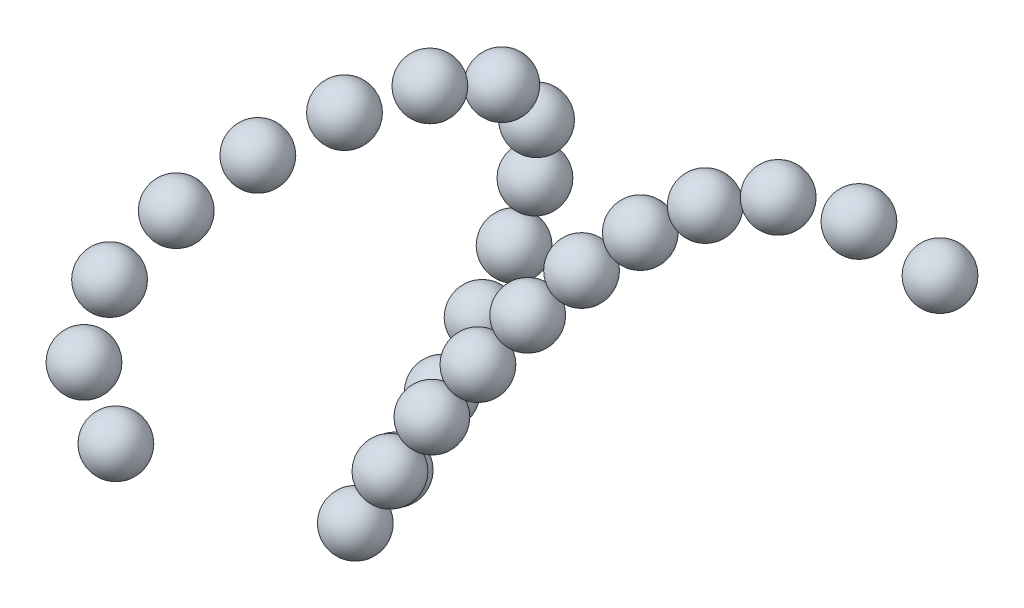
ISO-10303-21;
HEADER;
FILE_DESCRIPTION(('STEP AP214'),'2;1');
FILE_NAME('part.step','',(''),(''),'','','');
FILE_SCHEMA(('AUTOMOTIVE_DESIGN { 1 0 10303 214 1 1 1 1 }'));
ENDSEC;
DATA;
#1=APPLICATION_CONTEXT('core data for automotive mechanical design processes');
#2=APPLICATION_PROTOCOL_DEFINITION('international standard','automotive_design',2000,#1);
#3=PRODUCT_CONTEXT('',#1,'mechanical');
#4=PRODUCT('Part','Part','',(#3));
#5=PRODUCT_RELATED_PRODUCT_CATEGORY('part','',(#4));
#6=PRODUCT_DEFINITION_FORMATION('','',#4);
#7=PRODUCT_DEFINITION_CONTEXT('part definition',#1,'design');
#8=PRODUCT_DEFINITION('design','',#6,#7);
#9=PRODUCT_DEFINITION_SHAPE('','',#8);
#10=(LENGTH_UNIT() NAMED_UNIT(*) SI_UNIT(.MILLI.,.METRE.));
#11=(NAMED_UNIT(*) PLANE_ANGLE_UNIT() SI_UNIT($,.RADIAN.));
#12=(NAMED_UNIT(*) SI_UNIT($,.STERADIAN.) SOLID_ANGLE_UNIT());
#13=UNCERTAINTY_MEASURE_WITH_UNIT(LENGTH_MEASURE(1.E-05),#10,'distance_accuracy_value','');
#14=(GEOMETRIC_REPRESENTATION_CONTEXT(3) GLOBAL_UNCERTAINTY_ASSIGNED_CONTEXT((#13)) GLOBAL_UNIT_ASSIGNED_CONTEXT((#10,
#11,#12)) REPRESENTATION_CONTEXT('',''));
#15=CARTESIAN_POINT('',(0.,0.,0.));
#16=DIRECTION('',(0.,0.,1.));
#17=DIRECTION('',(1.,0.,0.));
#18=AXIS2_PLACEMENT_3D('',#15,#16,#17);
#19=CARTESIAN_POINT('',(-251.332586910343,-8.31631569000842,321.203037515905));
#20=DIRECTION('',(0.,1.,0.));
#21=DIRECTION('',(0.,0.,-1.));
#22=AXIS2_PLACEMENT_3D('',#19,#20,#21);
#23=SPHERICAL_SURFACE('',#22,16.6630073811328);
#24=CARTESIAN_POINT('',(-251.332586910343,8.34669169112437,321.203037515905));
#25=VERTEX_POINT('',#24);
#26=VERTEX_LOOP('',#25);
#27=FACE_BOUND('',#26,.T.);
#28=ADVANCED_FACE('F35',(#27),#23,.T.);
#29=CLOSED_SHELL('',(#28));
#30=MANIFOLD_SOLID_BREP('B2',#29);
#31=CARTESIAN_POINT('',(-293.923176967174,2.73844142392129,298.398368466478));
#32=DIRECTION('',(0.,1.,0.));
#33=DIRECTION('',(0.,0.,-1.));
#34=AXIS2_PLACEMENT_3D('',#31,#32,#33);
#35=SPHERICAL_SURFACE('',#34,16.6630073811328);
#36=CARTESIAN_POINT('',(-293.923176967174,19.4014488050541,298.398368466478));
#37=VERTEX_POINT('',#36);
#38=VERTEX_LOOP('',#37);
#39=FACE_BOUND('',#38,.T.);
#40=ADVANCED_FACE('F53',(#39),#35,.T.);
#41=CLOSED_SHELL('',(#40));
#42=MANIFOLD_SOLID_BREP('B6',#41);
#43=CARTESIAN_POINT('',(-319.059133540797,14.1268048959813,257.373121126579));
#44=DIRECTION('',(0.,1.,0.));
#45=DIRECTION('',(0.,0.,-1.));
#46=AXIS2_PLACEMENT_3D('',#43,#44,#45);
#47=SPHERICAL_SURFACE('',#46,16.6630073811328);
#48=CARTESIAN_POINT('',(-319.059133540797,30.7898122771141,257.373121126579));
#49=VERTEX_POINT('',#48);
#50=VERTEX_LOOP('',#49);
#51=FACE_BOUND('',#50,.T.);
#52=ADVANCED_FACE('F71',(#51),#47,.T.);
#53=CLOSED_SHELL('',(#52));
#54=MANIFOLD_SOLID_BREP('B31',#53);
#55=CARTESIAN_POINT('',(-326.170180751558,23.3578631800315,208.898601720223));
#56=DIRECTION('',(0.,1.,0.));
#57=DIRECTION('',(0.,0.,-1.));
#58=AXIS2_PLACEMENT_3D('',#55,#56,#57);
#59=SPHERICAL_SURFACE('',#58,16.6630073811328);
#60=CARTESIAN_POINT('',(-326.170180751558,40.0208705611642,208.898601720223));
#61=VERTEX_POINT('',#60);
#62=VERTEX_LOOP('',#61);
#63=FACE_BOUND('',#62,.T.);
#64=ADVANCED_FACE('F89',(#63),#59,.T.);
#65=CLOSED_SHELL('',(#64));
#66=MANIFOLD_SOLID_BREP('B49',#65);
#67=CARTESIAN_POINT('',(-325.201124377718,28.7571271886538,159.237148665191));
#68=DIRECTION('',(0.,1.,0.));
#69=DIRECTION('',(0.,0.,-1.));
#70=AXIS2_PLACEMENT_3D('',#67,#68,#69);
#71=SPHERICAL_SURFACE('',#70,16.6630073811328);
#72=CARTESIAN_POINT('',(-325.201124377718,45.4201345697865,159.237148665191));
#73=VERTEX_POINT('',#72);
#74=VERTEX_LOOP('',#73);
#75=FACE_BOUND('',#74,.T.);
#76=ADVANCED_FACE('F107',(#75),#71,.T.);
#77=CLOSED_SHELL('',(#76));
#78=MANIFOLD_SOLID_BREP('B67',#77);
#79=CARTESIAN_POINT('',(-321.223723213114,28.7782493936753,109.432174602055));
#80=DIRECTION('',(0.,1.,0.));
#81=DIRECTION('',(0.,0.,-1.));
#82=AXIS2_PLACEMENT_3D('',#79,#80,#81);
#83=SPHERICAL_SURFACE('',#82,16.6630073811328);
#84=CARTESIAN_POINT('',(-321.223723213114,45.4412567748081,109.432174602055));
#85=VERTEX_POINT('',#84);
#86=VERTEX_LOOP('',#85);
#87=FACE_BOUND('',#86,.T.);
#88=ADVANCED_FACE('F125',(#87),#83,.T.);
#89=CLOSED_SHELL('',(#88));
#90=MANIFOLD_SOLID_BREP('B85',#89);
#91=CARTESIAN_POINT('',(-317.302235347078,20.5820931474702,60.3610732469597));
#92=DIRECTION('',(0.,1.,0.));
#93=DIRECTION('',(0.,0.,-1.));
#94=AXIS2_PLACEMENT_3D('',#91,#92,#93);
#95=SPHERICAL_SURFACE('',#94,16.6630073811328);
#96=CARTESIAN_POINT('',(-317.302235347078,37.245100528603,60.3610732469597));
#97=VERTEX_POINT('',#96);
#98=VERTEX_LOOP('',#97);
#99=FACE_BOUND('',#98,.T.);
#100=ADVANCED_FACE('F143',(#99),#95,.T.);
#101=CLOSED_SHELL('',(#100));
#102=MANIFOLD_SOLID_BREP('B103',#101);
#103=CARTESIAN_POINT('',(-317.323716378429,-1.10490329116494,15.6753807634191));
#104=DIRECTION('',(0.,1.,0.));
#105=DIRECTION('',(0.,0.,-1.));
#106=AXIS2_PLACEMENT_3D('',#103,#104,#105);
#107=SPHERICAL_SURFACE('',#106,16.6630073811328);
#108=CARTESIAN_POINT('',(-317.323716378429,15.5581040899678,15.6753807634191));
#109=VERTEX_POINT('',#108);
#110=VERTEX_LOOP('',#109);
#111=FACE_BOUND('',#110,.T.);
#112=ADVANCED_FACE('F161',(#111),#107,.T.);
#113=CLOSED_SHELL('',(#112));
#114=MANIFOLD_SOLID_BREP('B121',#113);
#115=CARTESIAN_POINT('',(-325.916391497109,-39.3436940346708,-14.4857159539056));
#116=DIRECTION('',(0.,1.,0.));
#117=DIRECTION('',(0.,0.,-1.));
#118=AXIS2_PLACEMENT_3D('',#115,#116,#117);
#119=SPHERICAL_SURFACE('',#118,16.6630073811328);
#120=CARTESIAN_POINT('',(-325.916391497109,-22.680686653538,-14.4857159539056));
#121=VERTEX_POINT('',#120);
#122=VERTEX_LOOP('',#121);
#123=FACE_BOUND('',#122,.T.);
#124=ADVANCED_FACE('F179',(#123),#119,.T.);
#125=CLOSED_SHELL('',(#124));
#126=MANIFOLD_SOLID_BREP('B139',#125);
#127=CARTESIAN_POINT('',(-340.66666430228,-84.9409793318818,-28.2143946089285));
#128=DIRECTION('',(0.,1.,0.));
#129=DIRECTION('',(0.,0.,-1.));
#130=AXIS2_PLACEMENT_3D('',#127,#128,#129);
#131=SPHERICAL_SURFACE('',#130,16.6630073811328);
#132=CARTESIAN_POINT('',(-340.66666430228,-68.277971950749,-28.2143946089285));
#133=VERTEX_POINT('',#132);
#134=VERTEX_LOOP('',#133);
#135=FACE_BOUND('',#134,.T.);
#136=ADVANCED_FACE('F197',(#135),#131,.T.);
#137=CLOSED_SHELL('',(#136));
#138=MANIFOLD_SOLID_BREP('B157',#137);
#139=CARTESIAN_POINT('',(-357.698814044844,-131.72175381273,-32.321950558602));
#140=DIRECTION('',(0.,1.,0.));
#141=DIRECTION('',(0.,0.,-1.));
#142=AXIS2_PLACEMENT_3D('',#139,#140,#141);
#143=SPHERICAL_SURFACE('',#142,16.6630073811328);
#144=CARTESIAN_POINT('',(-357.698814044844,-115.058746431597,-32.321950558602));
#145=VERTEX_POINT('',#144);
#146=VERTEX_LOOP('',#145);
#147=FACE_BOUND('',#146,.T.);
#148=ADVANCED_FACE('F215',(#147),#143,.T.);
#149=CLOSED_SHELL('',(#148));
#150=MANIFOLD_SOLID_BREP('B175',#149);
#151=CARTESIAN_POINT('',(-375.649687370762,-178.326077860857,-30.4093126891423));
#152=DIRECTION('',(0.,1.,0.));
#153=DIRECTION('',(0.,0.,-1.));
#154=AXIS2_PLACEMENT_3D('',#151,#152,#153);
#155=SPHERICAL_SURFACE('',#154,16.6630073811328);
#156=CARTESIAN_POINT('',(-375.649687370762,-161.663070479724,-30.4093126891423));
#157=VERTEX_POINT('',#156);
#158=VERTEX_LOOP('',#157);
#159=FACE_BOUND('',#158,.T.);
#160=ADVANCED_FACE('F233',(#159),#155,.T.);
#161=CLOSED_SHELL('',(#160));
#162=MANIFOLD_SOLID_BREP('B193',#161);
#163=CARTESIAN_POINT('',(-393.917545592033,-224.398705766813,-23.9263707546768));
#164=DIRECTION('',(0.,1.,0.));
#165=DIRECTION('',(0.,0.,-1.));
#166=AXIS2_PLACEMENT_3D('',#163,#164,#165);
#167=SPHERICAL_SURFACE('',#166,16.6630073811328);
#168=CARTESIAN_POINT('',(-393.917545592033,-207.73569838568,-23.9263707546768));
#169=VERTEX_POINT('',#168);
#170=VERTEX_LOOP('',#169);
#171=FACE_BOUND('',#170,.T.);
#172=ADVANCED_FACE('F251',(#171),#167,.T.);
#173=CLOSED_SHELL('',(#172));
#174=MANIFOLD_SOLID_BREP('B211',#173);
#175=CARTESIAN_POINT('',(-411.92810765752,-269.655591038368,-12.7611431348232));
#176=DIRECTION('',(0.,1.,0.));
#177=DIRECTION('',(0.,0.,-1.));
#178=AXIS2_PLACEMENT_3D('',#175,#176,#177);
#179=SPHERICAL_SURFACE('',#178,16.6630073811328);
#180=CARTESIAN_POINT('',(-411.92810765752,-252.992583657235,-12.7611431348232));
#181=VERTEX_POINT('',#180);
#182=VERTEX_LOOP('',#181);
#183=FACE_BOUND('',#182,.T.);
#184=ADVANCED_FACE('F269',(#183),#179,.T.);
#185=CLOSED_SHELL('',(#184));
#186=MANIFOLD_SOLID_BREP('B229',#185);
#187=CARTESIAN_POINT('',(-414.891981622737,-288.918953339259,9.03957575350619));
#188=DIRECTION('',(0.,1.,0.));
#189=DIRECTION('',(0.,0.,-1.));
#190=AXIS2_PLACEMENT_3D('',#187,#188,#189);
#191=SPHERICAL_SURFACE('',#190,16.6630073811328);
#192=CARTESIAN_POINT('',(-414.891981622737,-272.255945958126,9.03957575350619));
#193=VERTEX_POINT('',#192);
#194=VERTEX_LOOP('',#193);
#195=FACE_BOUND('',#194,.T.);
#196=ADVANCED_FACE('F287',(#195),#191,.T.);
#197=CLOSED_SHELL('',(#196));
#198=MANIFOLD_SOLID_BREP('B247',#197);
#199=CARTESIAN_POINT('',(-389.364345904457,-246.176479457318,13.0898069452068));
#200=DIRECTION('',(0.,1.,0.));
#201=DIRECTION('',(0.,0.,-1.));
#202=AXIS2_PLACEMENT_3D('',#199,#200,#201);
#203=SPHERICAL_SURFACE('',#202,16.6630073811328);
#204=CARTESIAN_POINT('',(-389.364345904457,-229.513472076185,13.0898069452068));
#205=VERTEX_POINT('',#204);
#206=VERTEX_LOOP('',#205);
#207=FACE_BOUND('',#206,.T.);
#208=ADVANCED_FACE('F305',(#207),#203,.T.);
#209=CLOSED_SHELL('',(#208));
#210=MANIFOLD_SOLID_BREP('B265',#209);
#211=CARTESIAN_POINT('',(-362.981510258502,-203.709905211744,13.4456533905823));
#212=DIRECTION('',(0.,1.,0.));
#213=DIRECTION('',(0.,0.,-1.));
#214=AXIS2_PLACEMENT_3D('',#211,#212,#213);
#215=SPHERICAL_SURFACE('',#214,16.6630073811328);
#216=CARTESIAN_POINT('',(-362.981510258502,-187.046897830612,13.4456533905823));
#217=VERTEX_POINT('',#216);
#218=VERTEX_LOOP('',#217);
#219=FACE_BOUND('',#218,.T.);
#220=ADVANCED_FACE('F323',(#219),#215,.T.);
#221=CLOSED_SHELL('',(#220));
#222=MANIFOLD_SOLID_BREP('B283',#221);
#223=CARTESIAN_POINT('',(-335.281122892169,-162.097476910306,12.5694839886181));
#224=DIRECTION('',(0.,1.,0.));
#225=DIRECTION('',(0.,0.,-1.));
#226=AXIS2_PLACEMENT_3D('',#223,#224,#225);
#227=SPHERICAL_SURFACE('',#226,16.6630073811328);
#228=CARTESIAN_POINT('',(-335.281122892169,-145.434469529173,12.5694839886181));
#229=VERTEX_POINT('',#228);
#230=VERTEX_LOOP('',#229);
#231=FACE_BOUND('',#230,.T.);
#232=ADVANCED_FACE('F341',(#231),#227,.T.);
#233=CLOSED_SHELL('',(#232));
#234=MANIFOLD_SOLID_BREP('B301',#233);
#235=CARTESIAN_POINT('',(-305.922931698193,-121.659299839589,11.0246337200207));
#236=DIRECTION('',(0.,1.,0.));
#237=DIRECTION('',(0.,0.,-1.));
#238=AXIS2_PLACEMENT_3D('',#235,#236,#237);
#239=SPHERICAL_SURFACE('',#238,16.6630073811328);
#240=CARTESIAN_POINT('',(-305.922931698193,-104.996292458456,11.0246337200207));
#241=VERTEX_POINT('',#240);
#242=VERTEX_LOOP('',#241);
#243=FACE_BOUND('',#242,.T.);
#244=ADVANCED_FACE('F359',(#243),#239,.T.);
#245=CLOSED_SHELL('',(#244));
#246=MANIFOLD_SOLID_BREP('B319',#245);
#247=CARTESIAN_POINT('',(-274.463576004048,-82.8563700323748,9.06406609419982));
#248=DIRECTION('',(0.,1.,0.));
#249=DIRECTION('',(0.,0.,-1.));
#250=AXIS2_PLACEMENT_3D('',#247,#248,#249);
#251=SPHERICAL_SURFACE('',#250,16.6630073811328);
#252=CARTESIAN_POINT('',(-274.463576004048,-66.193362651242,9.06406609419982));
#253=VERTEX_POINT('',#252);
#254=VERTEX_LOOP('',#253);
#255=FACE_BOUND('',#254,.T.);
#256=ADVANCED_FACE('F377',(#255),#251,.T.);
#257=CLOSED_SHELL('',(#256));
#258=MANIFOLD_SOLID_BREP('B337',#257);
#259=CARTESIAN_POINT('',(-240.249105699165,-46.4851906178617,6.84953824632963));
#260=DIRECTION('',(0.,1.,0.));
#261=DIRECTION('',(0.,0.,-1.));
#262=AXIS2_PLACEMENT_3D('',#259,#260,#261);
#263=SPHERICAL_SURFACE('',#262,16.6630073811328);
#264=CARTESIAN_POINT('',(-240.249105699165,-29.822183236729,6.84953824632963));
#265=VERTEX_POINT('',#264);
#266=VERTEX_LOOP('',#265);
#267=FACE_BOUND('',#266,.T.);
#268=ADVANCED_FACE('F395',(#267),#263,.T.);
#269=CLOSED_SHELL('',(#268));
#270=MANIFOLD_SOLID_BREP('B355',#269);
#271=CARTESIAN_POINT('',(-202.273047216204,-14.1033979223435,4.53724579735682));
#272=DIRECTION('',(0.,1.,0.));
#273=DIRECTION('',(0.,0.,-1.));
#274=AXIS2_PLACEMENT_3D('',#271,#272,#273);
#275=SPHERICAL_SURFACE('',#274,16.6630073811328);
#276=CARTESIAN_POINT('',(-202.273047216204,2.55960945878931,4.53724579735682));
#277=VERTEX_POINT('',#276);
#278=VERTEX_LOOP('',#277);
#279=FACE_BOUND('',#278,.T.);
#280=ADVANCED_FACE('F413',(#279),#275,.T.);
#281=CLOSED_SHELL('',(#280));
#282=MANIFOLD_SOLID_BREP('B373',#281);
#283=CARTESIAN_POINT('',(-159.113541242546,10.8098047380692,2.38024360969227));
#284=DIRECTION('',(0.,1.,0.));
#285=DIRECTION('',(0.,0.,-1.));
#286=AXIS2_PLACEMENT_3D('',#283,#284,#285);
#287=SPHERICAL_SURFACE('',#286,16.6630073811328);
#288=CARTESIAN_POINT('',(-159.113541242546,27.472812119202,2.38024360969227));
#289=VERTEX_POINT('',#288);
#290=VERTEX_LOOP('',#289);
#291=FACE_BOUND('',#290,.T.);
#292=ADVANCED_FACE('F431',(#291),#287,.T.);
#293=CLOSED_SHELL('',(#292));
#294=MANIFOLD_SOLID_BREP('B391',#293);
#295=CARTESIAN_POINT('',(-110.534285652053,21.3769669184548,0.876856619796126));
#296=DIRECTION('',(0.,1.,0.));
#297=DIRECTION('',(0.,0.,-1.));
#298=AXIS2_PLACEMENT_3D('',#295,#296,#297);
#299=SPHERICAL_SURFACE('',#298,16.6630073811328);
#300=CARTESIAN_POINT('',(-110.534285652053,38.0399742995876,0.876856619796126));
#301=VERTEX_POINT('',#300);
#302=VERTEX_LOOP('',#301);
#303=FACE_BOUND('',#302,.T.);
#304=ADVANCED_FACE('F448',(#303),#299,.T.);
#305=CLOSED_SHELL('',(#304));
#306=MANIFOLD_SOLID_BREP('B409',#305);
#307=CARTESIAN_POINT('',(-60.8762719901552,16.7685517475527,0.203104960132542));
#308=DIRECTION('',(0.,1.,0.));
#309=DIRECTION('',(0.,0.,-1.));
#310=AXIS2_PLACEMENT_3D('',#307,#308,#309);
#311=SPHERICAL_SURFACE('',#310,16.6630073811328);
#312=CARTESIAN_POINT('',(-60.8762719901552,33.4315591286855,0.203104960132542));
#313=VERTEX_POINT('',#312);
#314=VERTEX_LOOP('',#313);
#315=FACE_BOUND('',#314,.T.);
#316=ADVANCED_FACE('F460',(#315),#311,.T.);
#317=CLOSED_SHELL('',(#316));
#318=MANIFOLD_SOLID_BREP('B427',#317);
#319=ADVANCED_BREP_SHAPE_REPRESENTATION('',(#18,#30,#42,#54,#66,#78,#90,#102,#114,#126,#138,
#150,#162,#174,#186,#198,#210,#222,#234,#246,#258,#270,#282,#294,#306,#318),#14);
#320=SHAPE_DEFINITION_REPRESENTATION(#9,#319);
ENDSEC;
END-ISO-10303-21;
